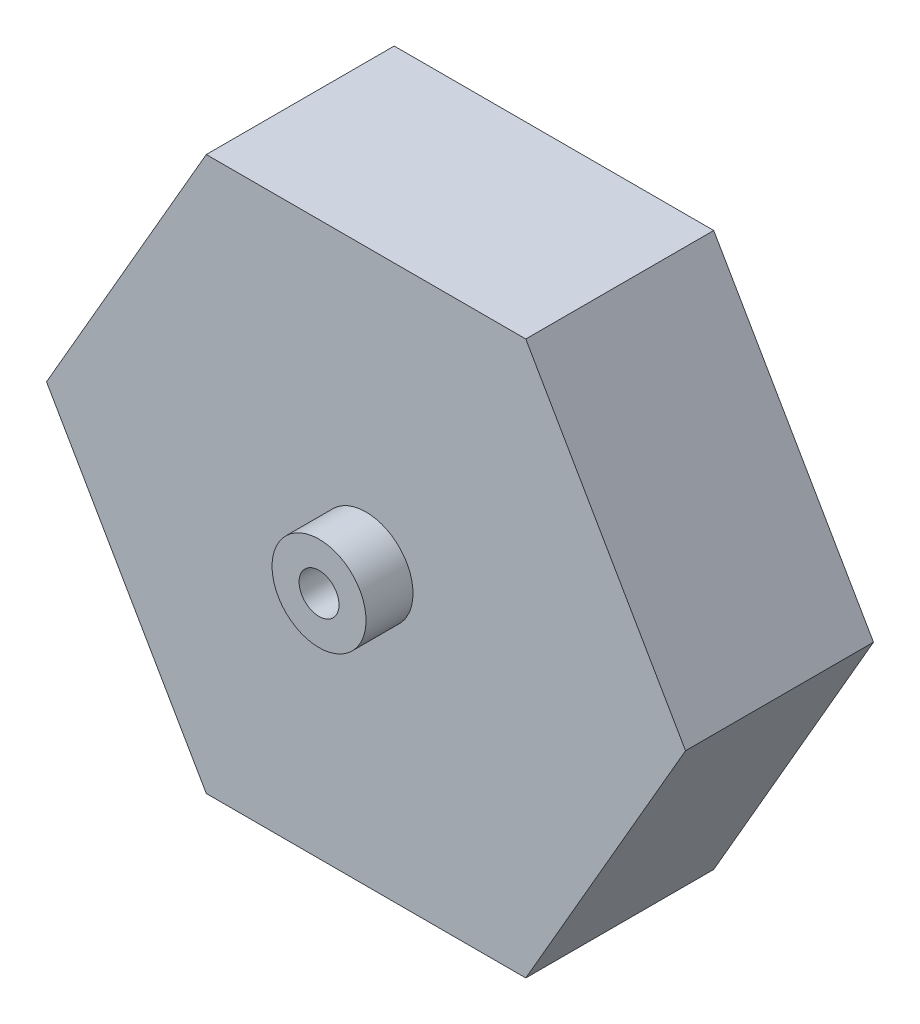
ISO-10303-21;
HEADER;
FILE_DESCRIPTION(('STEP AP214'),'2;1');
FILE_NAME('part.step','',(''),(''),'','','');
FILE_SCHEMA(('AUTOMOTIVE_DESIGN { 1 0 10303 214 1 1 1 1 }'));
ENDSEC;
DATA;
#1=APPLICATION_CONTEXT('core data for automotive mechanical design processes');
#2=APPLICATION_PROTOCOL_DEFINITION('international standard','automotive_design',2000,#1);
#3=PRODUCT_CONTEXT('',#1,'mechanical');
#4=PRODUCT('Part','Part','',(#3));
#5=PRODUCT_RELATED_PRODUCT_CATEGORY('part','',(#4));
#6=PRODUCT_DEFINITION_FORMATION('','',#4);
#7=PRODUCT_DEFINITION_CONTEXT('part definition',#1,'design');
#8=PRODUCT_DEFINITION('design','',#6,#7);
#9=PRODUCT_DEFINITION_SHAPE('','',#8);
#10=(LENGTH_UNIT() NAMED_UNIT(*) SI_UNIT(.MILLI.,.METRE.));
#11=(NAMED_UNIT(*) PLANE_ANGLE_UNIT() SI_UNIT($,.RADIAN.));
#12=(NAMED_UNIT(*) SI_UNIT($,.STERADIAN.) SOLID_ANGLE_UNIT());
#13=UNCERTAINTY_MEASURE_WITH_UNIT(LENGTH_MEASURE(1.E-05),#10,'distance_accuracy_value','');
#14=(GEOMETRIC_REPRESENTATION_CONTEXT(3) GLOBAL_UNCERTAINTY_ASSIGNED_CONTEXT((#13)) GLOBAL_UNIT_ASSIGNED_CONTEXT((#10,
#11,#12)) REPRESENTATION_CONTEXT('',''));
#15=CARTESIAN_POINT('',(0.,0.,0.));
#16=DIRECTION('',(0.,0.,1.));
#17=DIRECTION('',(1.,0.,0.));
#18=AXIS2_PLACEMENT_3D('',#15,#16,#17);
#19=CARTESIAN_POINT('',(-3.4,0.,4.));
#20=DIRECTION('',(0.86602540378444,-0.499999999999998,0.));
#21=DIRECTION('',(0.499999999999998,0.86602540378444,0.));
#22=AXIS2_PLACEMENT_3D('',#19,#20,#21);
#23=PLANE('',#22);
#24=DIRECTION('',(-0.499999999999998,-0.86602540378444,0.));
#25=VECTOR('',#24,1.);
#26=CARTESIAN_POINT('',(-3.4,0.,0.));
#27=LINE('',#26,#25);
#28=CARTESIAN_POINT('',(-3.4,0.,0.));
#29=VERTEX_POINT('',#28);
#30=CARTESIAN_POINT('',(-6.79999999999998,-5.88897274573419,0.));
#31=VERTEX_POINT('',#30);
#32=EDGE_CURVE('E118',#29,#31,#27,.T.);
#33=ORIENTED_EDGE('',*,*,#32,.T.);
#34=DIRECTION('',(0.,0.,-1.));
#35=VECTOR('',#34,1.);
#36=CARTESIAN_POINT('',(-6.79999999999998,-5.88897274573419,4.));
#37=LINE('',#36,#35);
#38=CARTESIAN_POINT('',(-6.79999999999998,-5.88897274573419,4.));
#39=VERTEX_POINT('',#38);
#40=EDGE_CURVE('E11',#39,#31,#37,.T.);
#41=ORIENTED_EDGE('',*,*,#40,.F.);
#42=DIRECTION('',(-0.499999999999998,-0.86602540378444,0.));
#43=VECTOR('',#42,1.);
#44=CARTESIAN_POINT('',(-3.4,0.,4.));
#45=LINE('',#44,#43);
#46=CARTESIAN_POINT('',(-3.4,0.,4.));
#47=VERTEX_POINT('',#46);
#48=EDGE_CURVE('E129',#47,#39,#45,.T.);
#49=ORIENTED_EDGE('',*,*,#48,.F.);
#50=DIRECTION('',(0.,0.,-1.));
#51=VECTOR('',#50,1.);
#52=CARTESIAN_POINT('',(-3.4,0.,4.));
#53=LINE('',#52,#51);
#54=EDGE_CURVE('E114',#47,#29,#53,.T.);
#55=ORIENTED_EDGE('',*,*,#54,.T.);
#56=EDGE_LOOP('',(#33,#41,#49,#55));
#57=FACE_BOUND('',#56,.T.);
#58=ADVANCED_FACE('F33',(#57),#23,.F.);
#59=CARTESIAN_POINT('',(-6.79999999999998,-5.88897274573419,4.));
#60=DIRECTION('',(0.86602540378444,0.499999999999998,0.));
#61=DIRECTION('',(-0.499999999999998,0.86602540378444,0.));
#62=AXIS2_PLACEMENT_3D('',#59,#60,#61);
#63=PLANE('',#62);
#64=DIRECTION('',(0.499999999999998,-0.86602540378444,0.));
#65=VECTOR('',#64,1.);
#66=CARTESIAN_POINT('',(-6.79999999999998,-5.88897274573419,0.));
#67=LINE('',#66,#65);
#68=CARTESIAN_POINT('',(-3.4,-11.7779454914684,0.));
#69=VERTEX_POINT('',#68);
#70=EDGE_CURVE('E121',#31,#69,#67,.T.);
#71=ORIENTED_EDGE('',*,*,#70,.T.);
#72=DIRECTION('',(0.,0.,-1.));
#73=VECTOR('',#72,1.);
#74=CARTESIAN_POINT('',(-3.4,-11.7779454914684,4.));
#75=LINE('',#74,#73);
#76=CARTESIAN_POINT('',(-3.4,-11.7779454914684,4.));
#77=VERTEX_POINT('',#76);
#78=EDGE_CURVE('E42',#77,#69,#75,.T.);
#79=ORIENTED_EDGE('',*,*,#78,.F.);
#80=DIRECTION('',(0.499999999999998,-0.86602540378444,0.));
#81=VECTOR('',#80,1.);
#82=CARTESIAN_POINT('',(-6.79999999999998,-5.88897274573419,4.));
#83=LINE('',#82,#81);
#84=EDGE_CURVE('E87',#39,#77,#83,.T.);
#85=ORIENTED_EDGE('',*,*,#84,.F.);
#86=ORIENTED_EDGE('',*,*,#40,.T.);
#87=EDGE_LOOP('',(#71,#79,#85,#86));
#88=FACE_BOUND('',#87,.T.);
#89=ADVANCED_FACE('F155',(#88),#63,.F.);
#90=CARTESIAN_POINT('',(-3.4,-11.7779454914684,4.));
#91=DIRECTION('',(0.,1.,0.));
#92=DIRECTION('',(0.,0.,1.));
#93=AXIS2_PLACEMENT_3D('',#90,#91,#92);
#94=PLANE('',#93);
#95=DIRECTION('',(1.,0.,0.));
#96=VECTOR('',#95,1.);
#97=CARTESIAN_POINT('',(-3.4,-11.7779454914684,0.));
#98=LINE('',#97,#96);
#99=CARTESIAN_POINT('',(3.4,-11.7779454914684,0.));
#100=VERTEX_POINT('',#99);
#101=EDGE_CURVE('E124',#69,#100,#98,.T.);
#102=ORIENTED_EDGE('',*,*,#101,.T.);
#103=DIRECTION('',(0.,0.,-1.));
#104=VECTOR('',#103,1.);
#105=CARTESIAN_POINT('',(3.4,-11.7779454914684,4.));
#106=LINE('',#105,#104);
#107=CARTESIAN_POINT('',(3.4,-11.7779454914684,4.));
#108=VERTEX_POINT('',#107);
#109=EDGE_CURVE('E109',#108,#100,#106,.T.);
#110=ORIENTED_EDGE('',*,*,#109,.F.);
#111=DIRECTION('',(1.,0.,0.));
#112=VECTOR('',#111,1.);
#113=CARTESIAN_POINT('',(-3.4,-11.7779454914684,4.));
#114=LINE('',#113,#112);
#115=EDGE_CURVE('E100',#77,#108,#114,.T.);
#116=ORIENTED_EDGE('',*,*,#115,.F.);
#117=ORIENTED_EDGE('',*,*,#78,.T.);
#118=EDGE_LOOP('',(#102,#110,#116,#117));
#119=FACE_BOUND('',#118,.T.);
#120=ADVANCED_FACE('F136',(#119),#94,.F.);
#121=CARTESIAN_POINT('',(6.79999999999999,-5.88897274573419,4.));
#122=DIRECTION('',(-0.86602540378444,0.499999999999998,0.));
#123=DIRECTION('',(-0.499999999999998,-0.86602540378444,0.));
#124=AXIS2_PLACEMENT_3D('',#121,#122,#123);
#125=PLANE('',#124);
#126=DIRECTION('',(0.499999999999998,0.86602540378444,0.));
#127=VECTOR('',#126,1.);
#128=CARTESIAN_POINT('',(6.79999999999999,-5.88897274573419,0.));
#129=LINE('',#128,#127);
#130=CARTESIAN_POINT('',(6.79999999999999,-5.88897274573419,0.));
#131=VERTEX_POINT('',#130);
#132=EDGE_CURVE('E108',#100,#131,#129,.T.);
#133=ORIENTED_EDGE('',*,*,#132,.T.);
#134=DIRECTION('',(0.,0.,-1.));
#135=VECTOR('',#134,1.);
#136=CARTESIAN_POINT('',(6.79999999999999,-5.88897274573419,4.));
#137=LINE('',#136,#135);
#138=CARTESIAN_POINT('',(6.79999999999999,-5.88897274573419,4.));
#139=VERTEX_POINT('',#138);
#140=EDGE_CURVE('E105',#139,#131,#137,.T.);
#141=ORIENTED_EDGE('',*,*,#140,.F.);
#142=DIRECTION('',(0.499999999999998,0.86602540378444,0.));
#143=VECTOR('',#142,1.);
#144=CARTESIAN_POINT('',(6.79999999999999,-5.88897274573419,4.));
#145=LINE('',#144,#143);
#146=EDGE_CURVE('E94',#108,#139,#145,.T.);
#147=ORIENTED_EDGE('',*,*,#146,.F.);
#148=ORIENTED_EDGE('',*,*,#109,.T.);
#149=EDGE_LOOP('',(#133,#141,#147,#148));
#150=FACE_BOUND('',#149,.T.);
#151=ADVANCED_FACE('F106',(#150),#125,.F.);
#152=CARTESIAN_POINT('',(3.4,0.,4.));
#153=DIRECTION('',(-0.86602540378444,-0.499999999999998,0.));
#154=DIRECTION('',(0.499999999999998,-0.86602540378444,0.));
#155=AXIS2_PLACEMENT_3D('',#152,#153,#154);
#156=PLANE('',#155);
#157=DIRECTION('',(-0.499999999999998,0.86602540378444,0.));
#158=VECTOR('',#157,1.);
#159=CARTESIAN_POINT('',(3.4,0.,0.));
#160=LINE('',#159,#158);
#161=CARTESIAN_POINT('',(3.4,0.,0.));
#162=VERTEX_POINT('',#161);
#163=EDGE_CURVE('E73',#131,#162,#160,.T.);
#164=ORIENTED_EDGE('',*,*,#163,.T.);
#165=DIRECTION('',(0.,0.,-1.));
#166=VECTOR('',#165,1.);
#167=CARTESIAN_POINT('',(3.4,0.,4.));
#168=LINE('',#167,#166);
#169=CARTESIAN_POINT('',(3.4,0.,4.));
#170=VERTEX_POINT('',#169);
#171=EDGE_CURVE('E110',#170,#162,#168,.T.);
#172=ORIENTED_EDGE('',*,*,#171,.F.);
#173=DIRECTION('',(-0.499999999999998,0.86602540378444,0.));
#174=VECTOR('',#173,1.);
#175=CARTESIAN_POINT('',(3.4,0.,4.));
#176=LINE('',#175,#174);
#177=EDGE_CURVE('E98',#139,#170,#176,.T.);
#178=ORIENTED_EDGE('',*,*,#177,.F.);
#179=ORIENTED_EDGE('',*,*,#140,.T.);
#180=EDGE_LOOP('',(#164,#172,#178,#179));
#181=FACE_BOUND('',#180,.T.);
#182=ADVANCED_FACE('F112',(#181),#156,.F.);
#183=CARTESIAN_POINT('',(3.4,0.,4.));
#184=DIRECTION('',(0.,-1.,0.));
#185=DIRECTION('',(1.,0.,0.));
#186=AXIS2_PLACEMENT_3D('',#183,#184,#185);
#187=PLANE('',#186);
#188=DIRECTION('',(-1.,0.,0.));
#189=VECTOR('',#188,1.);
#190=CARTESIAN_POINT('',(3.4,0.,0.));
#191=LINE('',#190,#189);
#192=EDGE_CURVE('E79',#162,#29,#191,.T.);
#193=ORIENTED_EDGE('',*,*,#192,.T.);
#194=ORIENTED_EDGE('',*,*,#54,.F.);
#195=DIRECTION('',(-1.,0.,0.));
#196=VECTOR('',#195,1.);
#197=CARTESIAN_POINT('',(3.4,0.,4.));
#198=LINE('',#197,#196);
#199=EDGE_CURVE('E50',#170,#47,#198,.T.);
#200=ORIENTED_EDGE('',*,*,#199,.F.);
#201=ORIENTED_EDGE('',*,*,#171,.T.);
#202=EDGE_LOOP('',(#193,#194,#200,#201));
#203=FACE_BOUND('',#202,.T.);
#204=ADVANCED_FACE('F143',(#203),#187,.F.);
#205=CARTESIAN_POINT('',(0.,0.,4.));
#206=DIRECTION('',(0.,0.,1.));
#207=DIRECTION('',(1.,0.,0.));
#208=AXIS2_PLACEMENT_3D('',#205,#206,#207);
#209=PLANE('',#208);
#210=CARTESIAN_POINT('',(0.,-5.88897274573419,4.));
#211=DIRECTION('',(0.,0.,1.));
#212=DIRECTION('',(1.,0.,0.));
#213=AXIS2_PLACEMENT_3D('',#210,#211,#212);
#214=CIRCLE('',#213,1.);
#215=CARTESIAN_POINT('',(1.,-5.88897274573419,4.));
#216=VERTEX_POINT('',#215);
#217=EDGE_CURVE('E234',#216,#216,#214,.T.);
#218=ORIENTED_EDGE('',*,*,#217,.F.);
#219=EDGE_LOOP('',(#218));
#220=FACE_BOUND('',#219,.T.);
#221=ORIENTED_EDGE('',*,*,#48,.T.);
#222=ORIENTED_EDGE('',*,*,#84,.T.);
#223=ORIENTED_EDGE('',*,*,#115,.T.);
#224=ORIENTED_EDGE('',*,*,#146,.T.);
#225=ORIENTED_EDGE('',*,*,#177,.T.);
#226=ORIENTED_EDGE('',*,*,#199,.T.);
#227=EDGE_LOOP('',(#221,#222,#223,#224,#225,#226));
#228=FACE_BOUND('',#227,.T.);
#229=ADVANCED_FACE('F96',(#220,#228),#209,.T.);
#230=CARTESIAN_POINT('',(0.,0.,0.));
#231=DIRECTION('',(0.,0.,1.));
#232=DIRECTION('',(1.,0.,0.));
#233=AXIS2_PLACEMENT_3D('',#230,#231,#232);
#234=PLANE('',#233);
#235=CARTESIAN_POINT('',(0.,-5.88897274573419,0.));
#236=DIRECTION('',(0.,0.,1.));
#237=DIRECTION('',(1.,0.,0.));
#238=AXIS2_PLACEMENT_3D('',#235,#236,#237);
#239=CIRCLE('',#238,0.425);
#240=CARTESIAN_POINT('',(0.425000000000001,-5.88897274573419,0.));
#241=VERTEX_POINT('',#240);
#242=EDGE_CURVE('E36',#241,#241,#239,.T.);
#243=ORIENTED_EDGE('',*,*,#242,.T.);
#244=EDGE_LOOP('',(#243));
#245=FACE_BOUND('',#244,.T.);
#246=ORIENTED_EDGE('',*,*,#32,.F.);
#247=ORIENTED_EDGE('',*,*,#192,.F.);
#248=ORIENTED_EDGE('',*,*,#163,.F.);
#249=ORIENTED_EDGE('',*,*,#132,.F.);
#250=ORIENTED_EDGE('',*,*,#101,.F.);
#251=ORIENTED_EDGE('',*,*,#70,.F.);
#252=EDGE_LOOP('',(#246,#247,#248,#249,#250,#251));
#253=FACE_BOUND('',#252,.T.);
#254=ADVANCED_FACE('F139',(#245,#253),#234,.F.);
#255=CARTESIAN_POINT('',(0.,-5.88897274573419,5.));
#256=DIRECTION('',(0.,0.,1.));
#257=DIRECTION('',(1.,0.,0.));
#258=AXIS2_PLACEMENT_3D('',#255,#256,#257);
#259=PLANE('',#258);
#260=CARTESIAN_POINT('',(0.,-5.88897274573419,5.));
#261=DIRECTION('',(0.,0.,1.));
#262=DIRECTION('',(1.,0.,0.));
#263=AXIS2_PLACEMENT_3D('',#260,#261,#262);
#264=CIRCLE('',#263,1.);
#265=CARTESIAN_POINT('',(1.,-5.88897274573419,5.));
#266=VERTEX_POINT('',#265);
#267=EDGE_CURVE('E122',#266,#266,#264,.T.);
#268=ORIENTED_EDGE('',*,*,#267,.T.);
#269=EDGE_LOOP('',(#268));
#270=FACE_BOUND('',#269,.T.);
#271=CARTESIAN_POINT('',(0.,-5.88897274573419,5.));
#272=DIRECTION('',(0.,0.,1.));
#273=DIRECTION('',(1.,0.,0.));
#274=AXIS2_PLACEMENT_3D('',#271,#272,#273);
#275=CIRCLE('',#274,0.425);
#276=CARTESIAN_POINT('',(0.425000000000001,-5.88897274573419,5.));
#277=VERTEX_POINT('',#276);
#278=EDGE_CURVE('E231',#277,#277,#275,.T.);
#279=ORIENTED_EDGE('',*,*,#278,.F.);
#280=EDGE_LOOP('',(#279));
#281=FACE_BOUND('',#280,.T.);
#282=ADVANCED_FACE('F190',(#270,#281),#259,.T.);
#283=CARTESIAN_POINT('',(0.,-5.88897274573419,5.));
#284=DIRECTION('',(0.,0.,-1.));
#285=DIRECTION('',(-1.,0.,0.));
#286=AXIS2_PLACEMENT_3D('',#283,#284,#285);
#287=CYLINDRICAL_SURFACE('',#286,1.);
#288=ORIENTED_EDGE('',*,*,#267,.F.);
#289=EDGE_LOOP('',(#288));
#290=FACE_BOUND('',#289,.T.);
#291=ORIENTED_EDGE('',*,*,#217,.T.);
#292=EDGE_LOOP('',(#291));
#293=FACE_BOUND('',#292,.T.);
#294=ADVANCED_FACE('F195',(#290,#293),#287,.T.);
#295=CARTESIAN_POINT('',(0.,-5.88897274573419,5.));
#296=DIRECTION('',(0.,0.,-1.));
#297=DIRECTION('',(-1.,0.,0.));
#298=AXIS2_PLACEMENT_3D('',#295,#296,#297);
#299=CYLINDRICAL_SURFACE('',#298,0.425);
#300=ORIENTED_EDGE('',*,*,#278,.T.);
#301=EDGE_LOOP('',(#300));
#302=FACE_BOUND('',#301,.T.);
#303=ORIENTED_EDGE('',*,*,#242,.F.);
#304=EDGE_LOOP('',(#303));
#305=FACE_BOUND('',#304,.T.);
#306=ADVANCED_FACE('F205',(#302,#305),#299,.F.);
#307=CLOSED_SHELL('',(#58,#89,#120,#151,#182,#204,#229,#254,#282,#294,#306));
#308=MANIFOLD_SOLID_BREP('B2',#307);
#309=ADVANCED_BREP_SHAPE_REPRESENTATION('',(#18,#308),#14);
#310=SHAPE_DEFINITION_REPRESENTATION(#9,#309);
ENDSEC;
END-ISO-10303-21;
